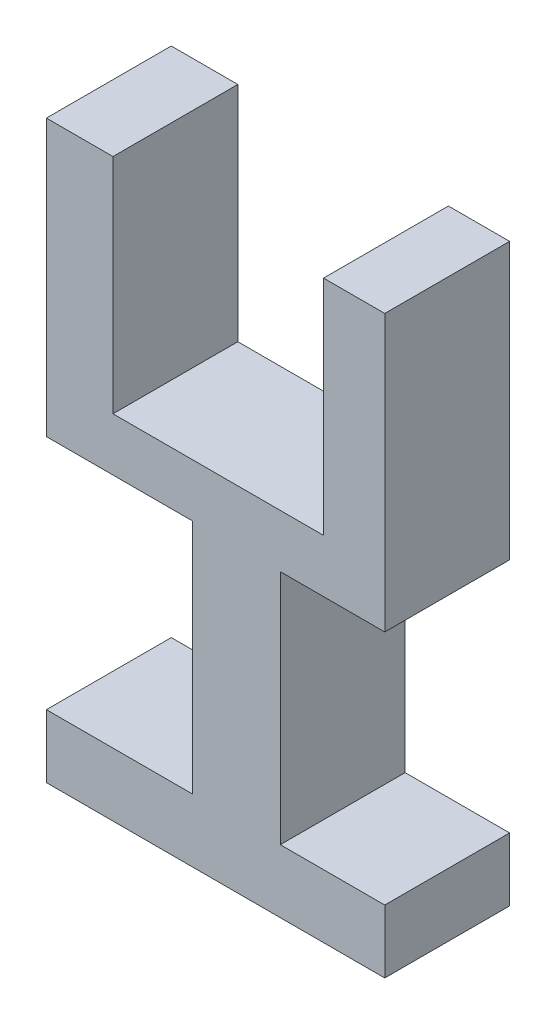
ISO-10303-21;
HEADER;
FILE_DESCRIPTION(('STEP AP214'),'2;1');
FILE_NAME('part.step','',(''),(''),'','','');
FILE_SCHEMA(('AUTOMOTIVE_DESIGN { 1 0 10303 214 1 1 1 1 }'));
ENDSEC;
DATA;
#1=APPLICATION_CONTEXT('core data for automotive mechanical design processes');
#2=APPLICATION_PROTOCOL_DEFINITION('international standard','automotive_design',2000,#1);
#3=PRODUCT_CONTEXT('',#1,'mechanical');
#4=PRODUCT('Part','Part','',(#3));
#5=PRODUCT_RELATED_PRODUCT_CATEGORY('part','',(#4));
#6=PRODUCT_DEFINITION_FORMATION('','',#4);
#7=PRODUCT_DEFINITION_CONTEXT('part definition',#1,'design');
#8=PRODUCT_DEFINITION('design','',#6,#7);
#9=PRODUCT_DEFINITION_SHAPE('','',#8);
#10=(LENGTH_UNIT() NAMED_UNIT(*) SI_UNIT(.MILLI.,.METRE.));
#11=(NAMED_UNIT(*) PLANE_ANGLE_UNIT() SI_UNIT($,.RADIAN.));
#12=(NAMED_UNIT(*) SI_UNIT($,.STERADIAN.) SOLID_ANGLE_UNIT());
#13=UNCERTAINTY_MEASURE_WITH_UNIT(LENGTH_MEASURE(1.E-05),#10,'distance_accuracy_value','');
#14=(GEOMETRIC_REPRESENTATION_CONTEXT(3) GLOBAL_UNCERTAINTY_ASSIGNED_CONTEXT((#13)) GLOBAL_UNIT_ASSIGNED_CONTEXT((#10,
#11,#12)) REPRESENTATION_CONTEXT('',''));
#15=CARTESIAN_POINT('',(0.,0.,0.));
#16=DIRECTION('',(0.,0.,1.));
#17=DIRECTION('',(1.,0.,0.));
#18=AXIS2_PLACEMENT_3D('',#15,#16,#17);
#19=CARTESIAN_POINT('',(-52.4590076253114,34.6870917341655,28.));
#20=DIRECTION('',(0.,-1.,0.));
#21=DIRECTION('',(0.,0.,-1.));
#22=AXIS2_PLACEMENT_3D('',#19,#20,#21);
#23=PLANE('',#22);
#24=DIRECTION('',(-1.,0.,0.));
#25=VECTOR('',#24,1.);
#26=CARTESIAN_POINT('',(-52.4590076253114,34.6870917341655,0.));
#27=LINE('',#26,#25);
#28=CARTESIAN_POINT('',(-37.5242944881474,34.6870917341655,0.));
#29=VERTEX_POINT('',#28);
#30=CARTESIAN_POINT('',(-52.4590076253114,34.6870917341655,0.));
#31=VERTEX_POINT('',#30);
#32=EDGE_CURVE('E177',#29,#31,#27,.T.);
#33=ORIENTED_EDGE('',*,*,#32,.T.);
#34=DIRECTION('',(0.,0.,-1.));
#35=VECTOR('',#34,1.);
#36=CARTESIAN_POINT('',(-52.4590076253114,34.6870917341655,28.));
#37=LINE('',#36,#35);
#38=CARTESIAN_POINT('',(-52.4590076253114,34.6870917341655,28.));
#39=VERTEX_POINT('',#38);
#40=EDGE_CURVE('E11',#39,#31,#37,.T.);
#41=ORIENTED_EDGE('',*,*,#40,.F.);
#42=DIRECTION('',(-1.,0.,0.));
#43=VECTOR('',#42,1.);
#44=CARTESIAN_POINT('',(-52.4590076253114,34.6870917341655,28.));
#45=LINE('',#44,#43);
#46=CARTESIAN_POINT('',(-37.5242944881474,34.6870917341655,28.));
#47=VERTEX_POINT('',#46);
#48=EDGE_CURVE('E207',#47,#39,#45,.T.);
#49=ORIENTED_EDGE('',*,*,#48,.F.);
#50=DIRECTION('',(0.,0.,-1.));
#51=VECTOR('',#50,1.);
#52=CARTESIAN_POINT('',(-37.5242944881474,34.6870917341655,28.));
#53=LINE('',#52,#51);
#54=EDGE_CURVE('E173',#47,#29,#53,.T.);
#55=ORIENTED_EDGE('',*,*,#54,.T.);
#56=EDGE_LOOP('',(#33,#41,#49,#55));
#57=FACE_BOUND('',#56,.T.);
#58=ADVANCED_FACE('F33',(#57),#23,.F.);
#59=CARTESIAN_POINT('',(-52.4590076253114,-27.182232836536,28.));
#60=DIRECTION('',(1.,0.,0.));
#61=DIRECTION('',(0.,0.,-1.));
#62=AXIS2_PLACEMENT_3D('',#59,#60,#61);
#63=PLANE('',#62);
#64=DIRECTION('',(0.,-1.,0.));
#65=VECTOR('',#64,1.);
#66=CARTESIAN_POINT('',(-52.4590076253114,-27.182232836536,0.));
#67=LINE('',#66,#65);
#68=CARTESIAN_POINT('',(-52.4590076253114,-27.182232836536,0.));
#69=VERTEX_POINT('',#68);
#70=EDGE_CURVE('E180',#31,#69,#67,.T.);
#71=ORIENTED_EDGE('',*,*,#70,.T.);
#72=DIRECTION('',(0.,0.,-1.));
#73=VECTOR('',#72,1.);
#74=CARTESIAN_POINT('',(-52.4590076253114,-27.182232836536,28.));
#75=LINE('',#74,#73);
#76=CARTESIAN_POINT('',(-52.4590076253114,-27.182232836536,28.));
#77=VERTEX_POINT('',#76);
#78=EDGE_CURVE('E41',#77,#69,#75,.T.);
#79=ORIENTED_EDGE('',*,*,#78,.F.);
#80=DIRECTION('',(0.,-1.,0.));
#81=VECTOR('',#80,1.);
#82=CARTESIAN_POINT('',(-52.4590076253114,-27.182232836536,28.));
#83=LINE('',#82,#81);
#84=EDGE_CURVE('E116',#39,#77,#83,.T.);
#85=ORIENTED_EDGE('',*,*,#84,.F.);
#86=ORIENTED_EDGE('',*,*,#40,.T.);
#87=EDGE_LOOP('',(#71,#79,#85,#86));
#88=FACE_BOUND('',#87,.T.);
#89=ADVANCED_FACE('F305',(#88),#63,.F.);
#90=CARTESIAN_POINT('',(-19.6426392553842,-27.182232836536,28.));
#91=DIRECTION('',(0.,1.,0.));
#92=DIRECTION('',(0.,0.,1.));
#93=AXIS2_PLACEMENT_3D('',#90,#91,#92);
#94=PLANE('',#93);
#95=DIRECTION('',(1.,0.,0.));
#96=VECTOR('',#95,1.);
#97=CARTESIAN_POINT('',(-19.6426392553842,-27.182232836536,0.));
#98=LINE('',#97,#96);
#99=CARTESIAN_POINT('',(-19.6426392553842,-27.182232836536,0.));
#100=VERTEX_POINT('',#99);
#101=EDGE_CURVE('E182',#69,#100,#98,.T.);
#102=ORIENTED_EDGE('',*,*,#101,.T.);
#103=DIRECTION('',(0.,0.,-1.));
#104=VECTOR('',#103,1.);
#105=CARTESIAN_POINT('',(-19.6426392553842,-27.182232836536,28.));
#106=LINE('',#105,#104);
#107=CARTESIAN_POINT('',(-19.6426392553842,-27.182232836536,28.));
#108=VERTEX_POINT('',#107);
#109=EDGE_CURVE('E238',#108,#100,#106,.T.);
#110=ORIENTED_EDGE('',*,*,#109,.F.);
#111=DIRECTION('',(1.,0.,0.));
#112=VECTOR('',#111,1.);
#113=CARTESIAN_POINT('',(-19.6426392553842,-27.182232836536,28.));
#114=LINE('',#113,#112);
#115=EDGE_CURVE('E246',#77,#108,#114,.T.);
#116=ORIENTED_EDGE('',*,*,#115,.F.);
#117=ORIENTED_EDGE('',*,*,#78,.T.);
#118=EDGE_LOOP('',(#102,#110,#116,#117));
#119=FACE_BOUND('',#118,.T.);
#120=ADVANCED_FACE('F244',(#119),#94,.F.);
#121=CARTESIAN_POINT('',(-19.6426392553842,-80.2164659309101,28.));
#122=DIRECTION('',(1.,0.,0.));
#123=DIRECTION('',(0.,0.,-1.));
#124=AXIS2_PLACEMENT_3D('',#121,#122,#123);
#125=PLANE('',#124);
#126=DIRECTION('',(0.,-1.,0.));
#127=VECTOR('',#126,1.);
#128=CARTESIAN_POINT('',(-19.6426392553842,-80.2164659309101,0.));
#129=LINE('',#128,#127);
#130=CARTESIAN_POINT('',(-19.6426392553842,-80.2164659309101,0.));
#131=VERTEX_POINT('',#130);
#132=EDGE_CURVE('E184',#100,#131,#129,.T.);
#133=ORIENTED_EDGE('',*,*,#132,.T.);
#134=DIRECTION('',(0.,0.,-1.));
#135=VECTOR('',#134,1.);
#136=CARTESIAN_POINT('',(-19.6426392553842,-80.2164659309101,28.));
#137=LINE('',#136,#135);
#138=CARTESIAN_POINT('',(-19.6426392553842,-80.2164659309101,28.));
#139=VERTEX_POINT('',#138);
#140=EDGE_CURVE('E235',#139,#131,#137,.T.);
#141=ORIENTED_EDGE('',*,*,#140,.F.);
#142=DIRECTION('',(0.,-1.,0.));
#143=VECTOR('',#142,1.);
#144=CARTESIAN_POINT('',(-19.6426392553842,-80.2164659309101,28.));
#145=LINE('',#144,#143);
#146=EDGE_CURVE('E264',#108,#139,#145,.T.);
#147=ORIENTED_EDGE('',*,*,#146,.F.);
#148=ORIENTED_EDGE('',*,*,#109,.T.);
#149=EDGE_LOOP('',(#133,#141,#147,#148));
#150=FACE_BOUND('',#149,.T.);
#151=ADVANCED_FACE('F255',(#150),#125,.F.);
#152=CARTESIAN_POINT('',(-52.4590076253114,-80.2164659309101,28.));
#153=DIRECTION('',(0.,-1.,0.));
#154=DIRECTION('',(0.,0.,-1.));
#155=AXIS2_PLACEMENT_3D('',#152,#153,#154);
#156=PLANE('',#155);
#157=DIRECTION('',(-1.,0.,0.));
#158=VECTOR('',#157,1.);
#159=CARTESIAN_POINT('',(-52.4590076253114,-80.2164659309101,0.));
#160=LINE('',#159,#158);
#161=CARTESIAN_POINT('',(-52.4590076253114,-80.2164659309101,0.));
#162=VERTEX_POINT('',#161);
#163=EDGE_CURVE('E186',#131,#162,#160,.T.);
#164=ORIENTED_EDGE('',*,*,#163,.T.);
#165=DIRECTION('',(0.,0.,-1.));
#166=VECTOR('',#165,1.);
#167=CARTESIAN_POINT('',(-52.4590076253114,-80.2164659309101,28.));
#168=LINE('',#167,#166);
#169=CARTESIAN_POINT('',(-52.4590076253114,-80.2164659309101,28.));
#170=VERTEX_POINT('',#169);
#171=EDGE_CURVE('E232',#170,#162,#168,.T.);
#172=ORIENTED_EDGE('',*,*,#171,.F.);
#173=DIRECTION('',(-1.,0.,0.));
#174=VECTOR('',#173,1.);
#175=CARTESIAN_POINT('',(-52.4590076253114,-80.2164659309101,28.));
#176=LINE('',#175,#174);
#177=EDGE_CURVE('E261',#139,#170,#176,.T.);
#178=ORIENTED_EDGE('',*,*,#177,.F.);
#179=ORIENTED_EDGE('',*,*,#140,.T.);
#180=EDGE_LOOP('',(#164,#172,#178,#179));
#181=FACE_BOUND('',#180,.T.);
#182=ADVANCED_FACE('F259',(#181),#156,.F.);
#183=CARTESIAN_POINT('',(-52.4590076253114,-94.3931370667186,28.));
#184=DIRECTION('',(1.,0.,0.));
#185=DIRECTION('',(0.,0.,-1.));
#186=AXIS2_PLACEMENT_3D('',#183,#184,#185);
#187=PLANE('',#186);
#188=DIRECTION('',(0.,-1.,0.));
#189=VECTOR('',#188,1.);
#190=CARTESIAN_POINT('',(-52.4590076253114,-94.3931370667186,0.));
#191=LINE('',#190,#189);
#192=CARTESIAN_POINT('',(-52.4590076253114,-94.3931370667186,0.));
#193=VERTEX_POINT('',#192);
#194=EDGE_CURVE('E188',#162,#193,#191,.T.);
#195=ORIENTED_EDGE('',*,*,#194,.T.);
#196=DIRECTION('',(0.,0.,-1.));
#197=VECTOR('',#196,1.);
#198=CARTESIAN_POINT('',(-52.4590076253114,-94.3931370667186,28.));
#199=LINE('',#198,#197);
#200=CARTESIAN_POINT('',(-52.4590076253114,-94.3931370667186,28.));
#201=VERTEX_POINT('',#200);
#202=EDGE_CURVE('E229',#201,#193,#199,.T.);
#203=ORIENTED_EDGE('',*,*,#202,.F.);
#204=DIRECTION('',(0.,-1.,0.));
#205=VECTOR('',#204,1.);
#206=CARTESIAN_POINT('',(-52.4590076253114,-94.3931370667186,28.));
#207=LINE('',#206,#205);
#208=EDGE_CURVE('E263',#170,#201,#207,.T.);
#209=ORIENTED_EDGE('',*,*,#208,.F.);
#210=ORIENTED_EDGE('',*,*,#171,.T.);
#211=EDGE_LOOP('',(#195,#203,#209,#210));
#212=FACE_BOUND('',#211,.T.);
#213=ADVANCED_FACE('F318',(#212),#187,.F.);
#214=CARTESIAN_POINT('',(23.4298033877213,-94.3931370667186,28.));
#215=DIRECTION('',(0.,1.,0.));
#216=DIRECTION('',(0.,0.,1.));
#217=AXIS2_PLACEMENT_3D('',#214,#215,#216);
#218=PLANE('',#217);
#219=DIRECTION('',(1.,0.,0.));
#220=VECTOR('',#219,1.);
#221=CARTESIAN_POINT('',(23.4298033877213,-94.3931370667186,0.));
#222=LINE('',#221,#220);
#223=CARTESIAN_POINT('',(23.4298033877213,-94.3931370667186,0.));
#224=VERTEX_POINT('',#223);
#225=EDGE_CURVE('E190',#193,#224,#222,.T.);
#226=ORIENTED_EDGE('',*,*,#225,.T.);
#227=DIRECTION('',(0.,0.,-1.));
#228=VECTOR('',#227,1.);
#229=CARTESIAN_POINT('',(23.4298033877213,-94.3931370667186,28.));
#230=LINE('',#229,#228);
#231=CARTESIAN_POINT('',(23.4298033877213,-94.3931370667186,28.));
#232=VERTEX_POINT('',#231);
#233=EDGE_CURVE('E226',#232,#224,#230,.T.);
#234=ORIENTED_EDGE('',*,*,#233,.F.);
#235=DIRECTION('',(1.,0.,0.));
#236=VECTOR('',#235,1.);
#237=CARTESIAN_POINT('',(23.4298033877213,-94.3931370667186,28.));
#238=LINE('',#237,#236);
#239=EDGE_CURVE('E266',#201,#232,#238,.T.);
#240=ORIENTED_EDGE('',*,*,#239,.F.);
#241=ORIENTED_EDGE('',*,*,#202,.T.);
#242=EDGE_LOOP('',(#226,#234,#240,#241));
#243=FACE_BOUND('',#242,.T.);
#244=ADVANCED_FACE('F321',(#243),#218,.F.);
#245=CARTESIAN_POINT('',(23.4298033877213,-80.2164659309101,28.));
#246=DIRECTION('',(-1.,0.,0.));
#247=DIRECTION('',(0.,0.,1.));
#248=AXIS2_PLACEMENT_3D('',#245,#246,#247);
#249=PLANE('',#248);
#250=DIRECTION('',(0.,1.,0.));
#251=VECTOR('',#250,1.);
#252=CARTESIAN_POINT('',(23.4298033877213,-80.2164659309101,0.));
#253=LINE('',#252,#251);
#254=CARTESIAN_POINT('',(23.4298033877213,-80.2164659309101,0.));
#255=VERTEX_POINT('',#254);
#256=EDGE_CURVE('E192',#224,#255,#253,.T.);
#257=ORIENTED_EDGE('',*,*,#256,.T.);
#258=DIRECTION('',(0.,0.,-1.));
#259=VECTOR('',#258,1.);
#260=CARTESIAN_POINT('',(23.4298033877213,-80.2164659309101,28.));
#261=LINE('',#260,#259);
#262=CARTESIAN_POINT('',(23.4298033877213,-80.2164659309101,28.));
#263=VERTEX_POINT('',#262);
#264=EDGE_CURVE('E223',#263,#255,#261,.T.);
#265=ORIENTED_EDGE('',*,*,#264,.F.);
#266=DIRECTION('',(0.,1.,0.));
#267=VECTOR('',#266,1.);
#268=CARTESIAN_POINT('',(23.4298033877213,-80.2164659309101,28.));
#269=LINE('',#268,#267);
#270=EDGE_CURVE('E272',#232,#263,#269,.T.);
#271=ORIENTED_EDGE('',*,*,#270,.F.);
#272=ORIENTED_EDGE('',*,*,#233,.T.);
#273=EDGE_LOOP('',(#257,#265,#271,#272));
#274=FACE_BOUND('',#273,.T.);
#275=ADVANCED_FACE('F325',(#274),#249,.F.);
#276=CARTESIAN_POINT('',(0.,-80.2164659309101,28.));
#277=DIRECTION('',(0.,-1.,0.));
#278=DIRECTION('',(0.,0.,-1.));
#279=AXIS2_PLACEMENT_3D('',#276,#277,#278);
#280=PLANE('',#279);
#281=DIRECTION('',(-1.,0.,0.));
#282=VECTOR('',#281,1.);
#283=CARTESIAN_POINT('',(0.,-80.2164659309101,0.));
#284=LINE('',#283,#282);
#285=CARTESIAN_POINT('',(0.,-80.2164659309101,0.));
#286=VERTEX_POINT('',#285);
#287=EDGE_CURVE('E194',#255,#286,#284,.T.);
#288=ORIENTED_EDGE('',*,*,#287,.T.);
#289=DIRECTION('',(0.,0.,-1.));
#290=VECTOR('',#289,1.);
#291=CARTESIAN_POINT('',(0.,-80.2164659309101,28.));
#292=LINE('',#291,#290);
#293=CARTESIAN_POINT('',(0.,-80.2164659309101,28.));
#294=VERTEX_POINT('',#293);
#295=EDGE_CURVE('E220',#294,#286,#292,.T.);
#296=ORIENTED_EDGE('',*,*,#295,.F.);
#297=DIRECTION('',(-1.,0.,0.));
#298=VECTOR('',#297,1.);
#299=CARTESIAN_POINT('',(0.,-80.2164659309101,28.));
#300=LINE('',#299,#298);
#301=EDGE_CURVE('E274',#263,#294,#300,.T.);
#302=ORIENTED_EDGE('',*,*,#301,.F.);
#303=ORIENTED_EDGE('',*,*,#264,.T.);
#304=EDGE_LOOP('',(#288,#296,#302,#303));
#305=FACE_BOUND('',#304,.T.);
#306=ADVANCED_FACE('F329',(#305),#280,.F.);
#307=CARTESIAN_POINT('',(0.,-27.182232836536,28.));
#308=DIRECTION('',(-1.,0.,0.));
#309=DIRECTION('',(0.,0.,1.));
#310=AXIS2_PLACEMENT_3D('',#307,#308,#309);
#311=PLANE('',#310);
#312=DIRECTION('',(0.,1.,0.));
#313=VECTOR('',#312,1.);
#314=CARTESIAN_POINT('',(0.,-27.182232836536,0.));
#315=LINE('',#314,#313);
#316=CARTESIAN_POINT('',(0.,-27.182232836536,0.));
#317=VERTEX_POINT('',#316);
#318=EDGE_CURVE('E196',#286,#317,#315,.T.);
#319=ORIENTED_EDGE('',*,*,#318,.T.);
#320=DIRECTION('',(0.,0.,-1.));
#321=VECTOR('',#320,1.);
#322=CARTESIAN_POINT('',(0.,-27.182232836536,28.));
#323=LINE('',#322,#321);
#324=CARTESIAN_POINT('',(0.,-27.182232836536,28.));
#325=VERTEX_POINT('',#324);
#326=EDGE_CURVE('E217',#325,#317,#323,.T.);
#327=ORIENTED_EDGE('',*,*,#326,.F.);
#328=DIRECTION('',(0.,1.,0.));
#329=VECTOR('',#328,1.);
#330=CARTESIAN_POINT('',(0.,-27.182232836536,28.));
#331=LINE('',#330,#329);
#332=EDGE_CURVE('E276',#294,#325,#331,.T.);
#333=ORIENTED_EDGE('',*,*,#332,.F.);
#334=ORIENTED_EDGE('',*,*,#295,.T.);
#335=EDGE_LOOP('',(#319,#327,#333,#334));
#336=FACE_BOUND('',#335,.T.);
#337=ADVANCED_FACE('F333',(#336),#311,.F.);
#338=CARTESIAN_POINT('',(23.4298033877213,-27.182232836536,28.));
#339=DIRECTION('',(0.,1.,0.));
#340=DIRECTION('',(0.,0.,1.));
#341=AXIS2_PLACEMENT_3D('',#338,#339,#340);
#342=PLANE('',#341);
#343=DIRECTION('',(1.,0.,0.));
#344=VECTOR('',#343,1.);
#345=CARTESIAN_POINT('',(23.4298033877213,-27.182232836536,0.));
#346=LINE('',#345,#344);
#347=CARTESIAN_POINT('',(23.4298033877213,-27.182232836536,0.));
#348=VERTEX_POINT('',#347);
#349=EDGE_CURVE('E198',#317,#348,#346,.T.);
#350=ORIENTED_EDGE('',*,*,#349,.T.);
#351=DIRECTION('',(0.,0.,-1.));
#352=VECTOR('',#351,1.);
#353=CARTESIAN_POINT('',(23.4298033877213,-27.182232836536,28.));
#354=LINE('',#353,#352);
#355=CARTESIAN_POINT('',(23.4298033877213,-27.182232836536,28.));
#356=VERTEX_POINT('',#355);
#357=EDGE_CURVE('E214',#356,#348,#354,.T.);
#358=ORIENTED_EDGE('',*,*,#357,.F.);
#359=DIRECTION('',(1.,0.,0.));
#360=VECTOR('',#359,1.);
#361=CARTESIAN_POINT('',(23.4298033877213,-27.182232836536,28.));
#362=LINE('',#361,#360);
#363=EDGE_CURVE('E278',#325,#356,#362,.T.);
#364=ORIENTED_EDGE('',*,*,#363,.F.);
#365=ORIENTED_EDGE('',*,*,#326,.T.);
#366=EDGE_LOOP('',(#350,#358,#364,#365));
#367=FACE_BOUND('',#366,.T.);
#368=ADVANCED_FACE('F337',(#367),#342,.F.);
#369=CARTESIAN_POINT('',(23.4298033877213,34.6870917341655,28.));
#370=DIRECTION('',(-1.,0.,0.));
#371=DIRECTION('',(0.,0.,1.));
#372=AXIS2_PLACEMENT_3D('',#369,#370,#371);
#373=PLANE('',#372);
#374=DIRECTION('',(0.,1.,0.));
#375=VECTOR('',#374,1.);
#376=CARTESIAN_POINT('',(23.4298033877213,34.6870917341655,0.));
#377=LINE('',#376,#375);
#378=CARTESIAN_POINT('',(23.4298033877213,34.6870917341655,0.));
#379=VERTEX_POINT('',#378);
#380=EDGE_CURVE('E200',#348,#379,#377,.T.);
#381=ORIENTED_EDGE('',*,*,#380,.T.);
#382=DIRECTION('',(0.,0.,-1.));
#383=VECTOR('',#382,1.);
#384=CARTESIAN_POINT('',(23.4298033877213,34.6870917341655,28.));
#385=LINE('',#384,#383);
#386=CARTESIAN_POINT('',(23.4298033877213,34.6870917341655,28.));
#387=VERTEX_POINT('',#386);
#388=EDGE_CURVE('E211',#387,#379,#385,.T.);
#389=ORIENTED_EDGE('',*,*,#388,.F.);
#390=DIRECTION('',(0.,1.,0.));
#391=VECTOR('',#390,1.);
#392=CARTESIAN_POINT('',(23.4298033877213,34.6870917341655,28.));
#393=LINE('',#392,#391);
#394=EDGE_CURVE('E280',#356,#387,#393,.T.);
#395=ORIENTED_EDGE('',*,*,#394,.F.);
#396=ORIENTED_EDGE('',*,*,#357,.T.);
#397=EDGE_LOOP('',(#381,#389,#395,#396));
#398=FACE_BOUND('',#397,.T.);
#399=ADVANCED_FACE('F286',(#398),#373,.F.);
#400=CARTESIAN_POINT('',(9.70140296522837,34.6870917341655,28.));
#401=DIRECTION('',(0.,-1.,0.));
#402=DIRECTION('',(0.,0.,-1.));
#403=AXIS2_PLACEMENT_3D('',#400,#401,#402);
#404=PLANE('',#403);
#405=DIRECTION('',(-1.,0.,0.));
#406=VECTOR('',#405,1.);
#407=CARTESIAN_POINT('',(9.70140296522837,34.6870917341655,0.));
#408=LINE('',#407,#406);
#409=CARTESIAN_POINT('',(9.70140296522837,34.6870917341655,0.));
#410=VERTEX_POINT('',#409);
#411=EDGE_CURVE('E202',#379,#410,#408,.T.);
#412=ORIENTED_EDGE('',*,*,#411,.T.);
#413=DIRECTION('',(0.,0.,-1.));
#414=VECTOR('',#413,1.);
#415=CARTESIAN_POINT('',(9.70140296522837,34.6870917341655,28.));
#416=LINE('',#415,#414);
#417=CARTESIAN_POINT('',(9.70140296522837,34.6870917341655,28.));
#418=VERTEX_POINT('',#417);
#419=EDGE_CURVE('E168',#418,#410,#416,.T.);
#420=ORIENTED_EDGE('',*,*,#419,.F.);
#421=DIRECTION('',(-1.,0.,0.));
#422=VECTOR('',#421,1.);
#423=CARTESIAN_POINT('',(9.70140296522837,34.6870917341655,28.));
#424=LINE('',#423,#422);
#425=EDGE_CURVE('E159',#387,#418,#424,.T.);
#426=ORIENTED_EDGE('',*,*,#425,.F.);
#427=ORIENTED_EDGE('',*,*,#388,.T.);
#428=EDGE_LOOP('',(#412,#420,#426,#427));
#429=FACE_BOUND('',#428,.T.);
#430=ADVANCED_FACE('F290',(#429),#404,.F.);
#431=CARTESIAN_POINT('',(9.70140296522837,-15.2842858037088,28.));
#432=DIRECTION('',(1.,0.,0.));
#433=DIRECTION('',(0.,0.,-1.));
#434=AXIS2_PLACEMENT_3D('',#431,#432,#433);
#435=PLANE('',#434);
#436=DIRECTION('',(0.,-1.,0.));
#437=VECTOR('',#436,1.);
#438=CARTESIAN_POINT('',(9.70140296522837,-15.2842858037088,0.));
#439=LINE('',#438,#437);
#440=CARTESIAN_POINT('',(9.70140296522837,-15.2842858037088,0.));
#441=VERTEX_POINT('',#440);
#442=EDGE_CURVE('E167',#410,#441,#439,.T.);
#443=ORIENTED_EDGE('',*,*,#442,.T.);
#444=DIRECTION('',(0.,0.,-1.));
#445=VECTOR('',#444,1.);
#446=CARTESIAN_POINT('',(9.70140296522837,-15.2842858037088,28.));
#447=LINE('',#446,#445);
#448=CARTESIAN_POINT('',(9.70140296522837,-15.2842858037088,28.));
#449=VERTEX_POINT('',#448);
#450=EDGE_CURVE('E164',#449,#441,#447,.T.);
#451=ORIENTED_EDGE('',*,*,#450,.F.);
#452=DIRECTION('',(0.,-1.,0.));
#453=VECTOR('',#452,1.);
#454=CARTESIAN_POINT('',(9.70140296522837,-15.2842858037088,28.));
#455=LINE('',#454,#453);
#456=EDGE_CURVE('E153',#418,#449,#455,.T.);
#457=ORIENTED_EDGE('',*,*,#456,.F.);
#458=ORIENTED_EDGE('',*,*,#419,.T.);
#459=EDGE_LOOP('',(#443,#451,#457,#458));
#460=FACE_BOUND('',#459,.T.);
#461=ADVANCED_FACE('F165',(#460),#435,.F.);
#462=CARTESIAN_POINT('',(-37.5242944881474,-15.2842858037088,28.));
#463=DIRECTION('',(0.,-1.,0.));
#464=DIRECTION('',(0.,0.,-1.));
#465=AXIS2_PLACEMENT_3D('',#462,#463,#464);
#466=PLANE('',#465);
#467=DIRECTION('',(-1.,0.,0.));
#468=VECTOR('',#467,1.);
#469=CARTESIAN_POINT('',(-37.5242944881474,-15.2842858037088,0.));
#470=LINE('',#469,#468);
#471=CARTESIAN_POINT('',(-37.5242944881474,-15.2842858037088,0.));
#472=VERTEX_POINT('',#471);
#473=EDGE_CURVE('E102',#441,#472,#470,.T.);
#474=ORIENTED_EDGE('',*,*,#473,.T.);
#475=DIRECTION('',(0.,0.,-1.));
#476=VECTOR('',#475,1.);
#477=CARTESIAN_POINT('',(-37.5242944881474,-15.2842858037088,28.));
#478=LINE('',#477,#476);
#479=CARTESIAN_POINT('',(-37.5242944881474,-15.2842858037088,28.));
#480=VERTEX_POINT('',#479);
#481=EDGE_CURVE('E169',#480,#472,#478,.T.);
#482=ORIENTED_EDGE('',*,*,#481,.F.);
#483=DIRECTION('',(-1.,0.,0.));
#484=VECTOR('',#483,1.);
#485=CARTESIAN_POINT('',(-37.5242944881474,-15.2842858037088,28.));
#486=LINE('',#485,#484);
#487=EDGE_CURVE('E157',#449,#480,#486,.T.);
#488=ORIENTED_EDGE('',*,*,#487,.F.);
#489=ORIENTED_EDGE('',*,*,#450,.T.);
#490=EDGE_LOOP('',(#474,#482,#488,#489));
#491=FACE_BOUND('',#490,.T.);
#492=ADVANCED_FACE('F171',(#491),#466,.F.);
#493=CARTESIAN_POINT('',(-37.5242944881474,34.6870917341655,28.));
#494=DIRECTION('',(-1.,0.,0.));
#495=DIRECTION('',(0.,0.,1.));
#496=AXIS2_PLACEMENT_3D('',#493,#494,#495);
#497=PLANE('',#496);
#498=DIRECTION('',(0.,1.,0.));
#499=VECTOR('',#498,1.);
#500=CARTESIAN_POINT('',(-37.5242944881474,34.6870917341655,0.));
#501=LINE('',#500,#499);
#502=EDGE_CURVE('E108',#472,#29,#501,.T.);
#503=ORIENTED_EDGE('',*,*,#502,.T.);
#504=ORIENTED_EDGE('',*,*,#54,.F.);
#505=DIRECTION('',(0.,1.,0.));
#506=VECTOR('',#505,1.);
#507=CARTESIAN_POINT('',(-37.5242944881474,34.6870917341655,28.));
#508=LINE('',#507,#506);
#509=EDGE_CURVE('E49',#480,#47,#508,.T.);
#510=ORIENTED_EDGE('',*,*,#509,.F.);
#511=ORIENTED_EDGE('',*,*,#481,.T.);
#512=EDGE_LOOP('',(#503,#504,#510,#511));
#513=FACE_BOUND('',#512,.T.);
#514=ADVANCED_FACE('F294',(#513),#497,.F.);
#515=CARTESIAN_POINT('',(0.,0.,28.));
#516=DIRECTION('',(0.,0.,-1.));
#517=DIRECTION('',(-1.,0.,0.));
#518=AXIS2_PLACEMENT_3D('',#515,#516,#517);
#519=PLANE('',#518);
#520=ORIENTED_EDGE('',*,*,#48,.T.);
#521=ORIENTED_EDGE('',*,*,#84,.T.);
#522=ORIENTED_EDGE('',*,*,#115,.T.);
#523=ORIENTED_EDGE('',*,*,#146,.T.);
#524=ORIENTED_EDGE('',*,*,#177,.T.);
#525=ORIENTED_EDGE('',*,*,#208,.T.);
#526=ORIENTED_EDGE('',*,*,#239,.T.);
#527=ORIENTED_EDGE('',*,*,#270,.T.);
#528=ORIENTED_EDGE('',*,*,#301,.T.);
#529=ORIENTED_EDGE('',*,*,#332,.T.);
#530=ORIENTED_EDGE('',*,*,#363,.T.);
#531=ORIENTED_EDGE('',*,*,#394,.T.);
#532=ORIENTED_EDGE('',*,*,#425,.T.);
#533=ORIENTED_EDGE('',*,*,#456,.T.);
#534=ORIENTED_EDGE('',*,*,#487,.T.);
#535=ORIENTED_EDGE('',*,*,#509,.T.);
#536=EDGE_LOOP('',(#520,#521,#522,#523,#524,#525,#526,#527,#528,#529,#530,#531,#532,#533,#534,#535));
#537=FACE_BOUND('',#536,.T.);
#538=ADVANCED_FACE('F155',(#537),#519,.F.);
#539=CARTESIAN_POINT('',(0.,0.,0.));
#540=DIRECTION('',(0.,0.,-1.));
#541=DIRECTION('',(-1.,0.,0.));
#542=AXIS2_PLACEMENT_3D('',#539,#540,#541);
#543=PLANE('',#542);
#544=ORIENTED_EDGE('',*,*,#32,.F.);
#545=ORIENTED_EDGE('',*,*,#502,.F.);
#546=ORIENTED_EDGE('',*,*,#473,.F.);
#547=ORIENTED_EDGE('',*,*,#442,.F.);
#548=ORIENTED_EDGE('',*,*,#411,.F.);
#549=ORIENTED_EDGE('',*,*,#380,.F.);
#550=ORIENTED_EDGE('',*,*,#349,.F.);
#551=ORIENTED_EDGE('',*,*,#318,.F.);
#552=ORIENTED_EDGE('',*,*,#287,.F.);
#553=ORIENTED_EDGE('',*,*,#256,.F.);
#554=ORIENTED_EDGE('',*,*,#225,.F.);
#555=ORIENTED_EDGE('',*,*,#194,.F.);
#556=ORIENTED_EDGE('',*,*,#163,.F.);
#557=ORIENTED_EDGE('',*,*,#132,.F.);
#558=ORIENTED_EDGE('',*,*,#101,.F.);
#559=ORIENTED_EDGE('',*,*,#70,.F.);
#560=EDGE_LOOP('',(#544,#545,#546,#547,#548,#549,#550,#551,#552,#553,#554,#555,#556,#557,#558,#559));
#561=FACE_BOUND('',#560,.T.);
#562=ADVANCED_FACE('F250',(#561),#543,.T.);
#563=CLOSED_SHELL('',(#58,#89,#120,#151,#182,#213,#244,#275,#306,#337,#368,#399,#430,#461,#492,
#514,#538,#562));
#564=MANIFOLD_SOLID_BREP('B2',#563);
#565=ADVANCED_BREP_SHAPE_REPRESENTATION('',(#18,#564),#14);
#566=SHAPE_DEFINITION_REPRESENTATION(#9,#565);
ENDSEC;
END-ISO-10303-21;
